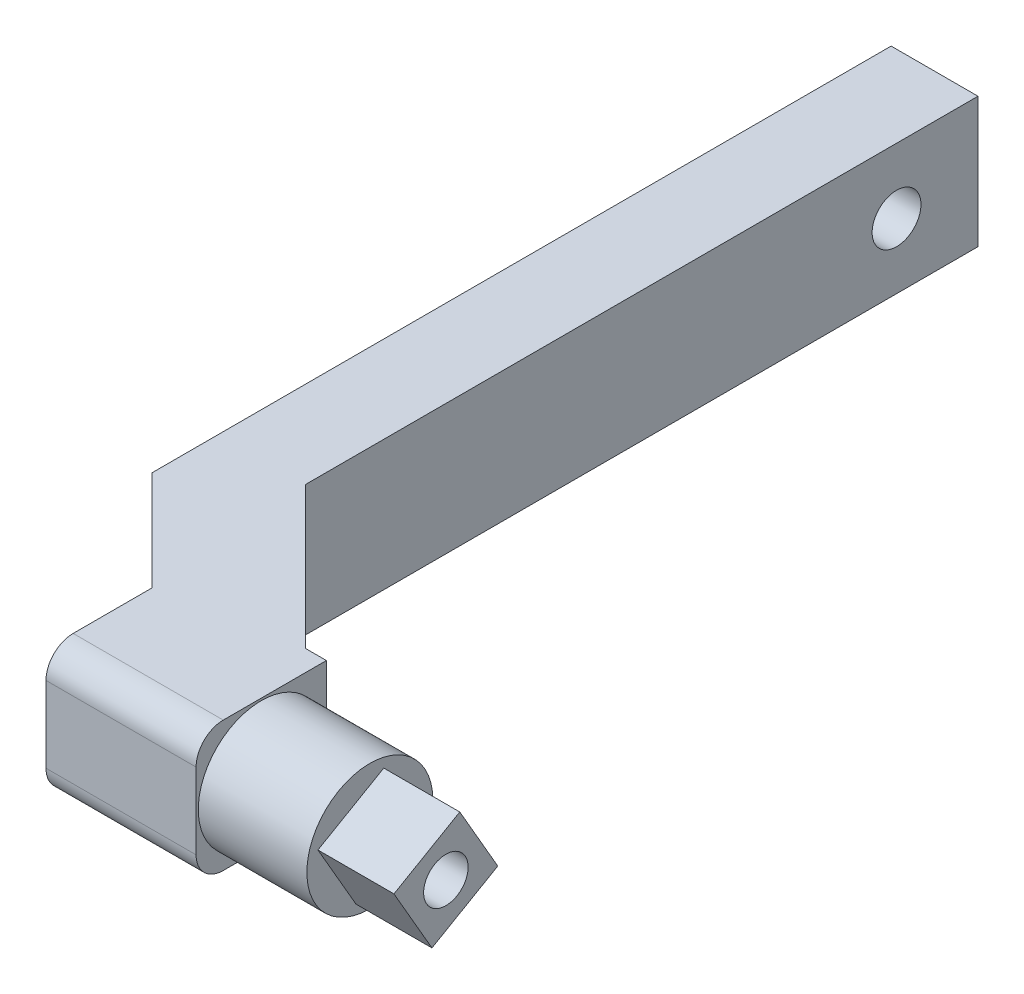
ISO-10303-21;
HEADER;
FILE_DESCRIPTION(('STEP AP214'),'2;1');
FILE_NAME('part.step','',(''),(''),'','','');
FILE_SCHEMA(('AUTOMOTIVE_DESIGN { 1 0 10303 214 1 1 1 1 }'));
ENDSEC;
DATA;
#1=APPLICATION_CONTEXT('core data for automotive mechanical design processes');
#2=APPLICATION_PROTOCOL_DEFINITION('international standard','automotive_design',2000,#1);
#3=PRODUCT_CONTEXT('',#1,'mechanical');
#4=PRODUCT('Part','Part','',(#3));
#5=PRODUCT_RELATED_PRODUCT_CATEGORY('part','',(#4));
#6=PRODUCT_DEFINITION_FORMATION('','',#4);
#7=PRODUCT_DEFINITION_CONTEXT('part definition',#1,'design');
#8=PRODUCT_DEFINITION('design','',#6,#7);
#9=PRODUCT_DEFINITION_SHAPE('','',#8);
#10=(LENGTH_UNIT() NAMED_UNIT(*) SI_UNIT(.MILLI.,.METRE.));
#11=(NAMED_UNIT(*) PLANE_ANGLE_UNIT() SI_UNIT($,.RADIAN.));
#12=(NAMED_UNIT(*) SI_UNIT($,.STERADIAN.) SOLID_ANGLE_UNIT());
#13=UNCERTAINTY_MEASURE_WITH_UNIT(LENGTH_MEASURE(1.E-05),#10,'distance_accuracy_value','');
#14=(GEOMETRIC_REPRESENTATION_CONTEXT(3) GLOBAL_UNCERTAINTY_ASSIGNED_CONTEXT((#13)) GLOBAL_UNIT_ASSIGNED_CONTEXT((#10,
#11,#12)) REPRESENTATION_CONTEXT('',''));
#15=CARTESIAN_POINT('',(0.,0.,0.));
#16=DIRECTION('',(0.,0.,1.));
#17=DIRECTION('',(1.,0.,0.));
#18=AXIS2_PLACEMENT_3D('',#15,#16,#17);
#19=CARTESIAN_POINT('',(14.,24.,0.));
#20=DIRECTION('',(-1.,0.,0.));
#21=DIRECTION('',(0.,0.,1.));
#22=AXIS2_PLACEMENT_3D('',#19,#20,#21);
#23=PLANE('',#22);
#24=CARTESIAN_POINT('',(14.,12.,2.14213562373101));
#25=DIRECTION('',(1.,0.,0.));
#26=DIRECTION('',(0.,0.,-1.));
#27=AXIS2_PLACEMENT_3D('',#24,#25,#26);
#28=CIRCLE('',#27,11.6);
#29=CARTESIAN_POINT('',(14.,12.,-9.45786437626898));
#30=VERTEX_POINT('',#29);
#31=EDGE_CURVE('E167',#30,#30,#28,.T.);
#32=ORIENTED_EDGE('',*,*,#31,.T.);
#33=EDGE_LOOP('',(#32));
#34=FACE_BOUND('',#33,.T.);
#35=DIRECTION('',(0.,0.866025403784441,0.499999999999995));
#36=VECTOR('',#35,1.);
#37=CARTESIAN_POINT('',(14.,21.5621778264911,-0.42004220276011));
#38=LINE('',#37,#36);
#39=CARTESIAN_POINT('',(14.,9.43782217350888,-7.42004220276004));
#40=VERTEX_POINT('',#39);
#41=CARTESIAN_POINT('',(14.,21.5621778264911,-0.42004220276011));
#42=VERTEX_POINT('',#41);
#43=EDGE_CURVE('E163',#40,#42,#38,.T.);
#44=ORIENTED_EDGE('',*,*,#43,.F.);
#45=DIRECTION('',(0.,0.499999999999995,-0.866025403784442));
#46=VECTOR('',#45,1.);
#47=CARTESIAN_POINT('',(14.,9.43782217350888,-7.42004220276004));
#48=LINE('',#47,#46);
#49=CARTESIAN_POINT('',(14.,2.43782217350895,4.70431345022215));
#50=VERTEX_POINT('',#49);
#51=EDGE_CURVE('E160',#50,#40,#48,.T.);
#52=ORIENTED_EDGE('',*,*,#51,.F.);
#53=DIRECTION('',(0.,-0.866025403784442,-0.499999999999995));
#54=VECTOR('',#53,1.);
#55=CARTESIAN_POINT('',(14.,14.5621778264911,11.7043134502221));
#56=LINE('',#55,#54);
#57=CARTESIAN_POINT('',(14.,14.5621778264911,11.7043134502221));
#58=VERTEX_POINT('',#57);
#59=EDGE_CURVE('E56',#58,#50,#56,.T.);
#60=ORIENTED_EDGE('',*,*,#59,.F.);
#61=DIRECTION('',(0.,-0.499999999999995,0.866025403784441));
#62=VECTOR('',#61,1.);
#63=CARTESIAN_POINT('',(14.,21.5621778264911,-0.42004220276011));
#64=LINE('',#63,#62);
#65=EDGE_CURVE('E51',#42,#58,#64,.T.);
#66=ORIENTED_EDGE('',*,*,#65,.F.);
#67=EDGE_LOOP('',(#44,#52,#60,#66));
#68=FACE_BOUND('',#67,.T.);
#69=ADVANCED_FACE('F35',(#34,#68),#23,.F.);
#70=CARTESIAN_POINT('',(-5.98849367254463E-13,24.,14.1421356237333));
#71=DIRECTION('',(0.,0.,-1.));
#72=DIRECTION('',(-1.,0.,0.));
#73=AXIS2_PLACEMENT_3D('',#70,#71,#72);
#74=PLANE('',#73);
#75=DIRECTION('',(0.,-1.,0.));
#76=VECTOR('',#75,1.);
#77=CARTESIAN_POINT('',(-33.6421356237309,24.,14.1421356237318));
#78=LINE('',#77,#76);
#79=CARTESIAN_POINT('',(-33.6421356237309,19.,14.1421356237318));
#80=VERTEX_POINT('',#79);
#81=CARTESIAN_POINT('',(-33.6421356237309,5.,14.1421356237318));
#82=VERTEX_POINT('',#81);
#83=EDGE_CURVE('E209',#80,#82,#78,.T.);
#84=ORIENTED_EDGE('',*,*,#83,.T.);
#85=DIRECTION('',(1.,0.,0.));
#86=VECTOR('',#85,1.);
#87=CARTESIAN_POINT('',(-5.98849367254463E-13,5.,14.1421356237333));
#88=LINE('',#87,#86);
#89=CARTESIAN_POINT('',(-6.,5.,14.142135623731));
#90=VERTEX_POINT('',#89);
#91=EDGE_CURVE('E245',#82,#90,#88,.T.);
#92=ORIENTED_EDGE('',*,*,#91,.T.);
#93=DIRECTION('',(0.,-1.,0.));
#94=VECTOR('',#93,1.);
#95=CARTESIAN_POINT('',(-6.,0.,14.142135623731));
#96=LINE('',#95,#94);
#97=CARTESIAN_POINT('',(-6.,19.,14.142135623731));
#98=VERTEX_POINT('',#97);
#99=EDGE_CURVE('E176',#98,#90,#96,.T.);
#100=ORIENTED_EDGE('',*,*,#99,.F.);
#101=DIRECTION('',(1.,0.,0.));
#102=VECTOR('',#101,1.);
#103=CARTESIAN_POINT('',(-33.6421356237309,19.,14.1421356237318));
#104=LINE('',#103,#102);
#105=EDGE_CURVE('E243',#98,#80,#104,.F.);
#106=ORIENTED_EDGE('',*,*,#105,.T.);
#107=EDGE_LOOP('',(#84,#92,#100,#106));
#108=FACE_BOUND('',#107,.T.);
#109=ADVANCED_FACE('F266',(#108),#74,.F.);
#110=CARTESIAN_POINT('',(0.,24.,-9.857864376269));
#111=DIRECTION('',(0.,0.,-1.));
#112=DIRECTION('',(-1.,0.,0.));
#113=AXIS2_PLACEMENT_3D('',#110,#111,#112);
#114=PLANE('',#113);
#115=DIRECTION('',(1.,0.,0.));
#116=VECTOR('',#115,1.);
#117=CARTESIAN_POINT('',(0.,24.,-9.857864376269));
#118=LINE('',#117,#116);
#119=CARTESIAN_POINT('',(-9.85786437626935,24.,-9.857864376269));
#120=VERTEX_POINT('',#119);
#121=CARTESIAN_POINT('',(-5.99999999999997,24.,-9.85786437626902));
#122=VERTEX_POINT('',#121);
#123=EDGE_CURVE('E189',#120,#122,#118,.T.);
#124=ORIENTED_EDGE('',*,*,#123,.T.);
#125=DIRECTION('',(0.,1.,0.));
#126=VECTOR('',#125,1.);
#127=CARTESIAN_POINT('',(-5.99999999999997,0.,-9.85786437626902));
#128=LINE('',#127,#126);
#129=CARTESIAN_POINT('',(-5.99999999999997,0.,-9.85786437626902));
#130=VERTEX_POINT('',#129);
#131=EDGE_CURVE('E181',#130,#122,#128,.T.);
#132=ORIENTED_EDGE('',*,*,#131,.F.);
#133=DIRECTION('',(1.,0.,0.));
#134=VECTOR('',#133,1.);
#135=CARTESIAN_POINT('',(0.,0.,-9.857864376269));
#136=LINE('',#135,#134);
#137=CARTESIAN_POINT('',(-9.85786437626935,0.,-9.857864376269));
#138=VERTEX_POINT('',#137);
#139=EDGE_CURVE('E186',#138,#130,#136,.T.);
#140=ORIENTED_EDGE('',*,*,#139,.F.);
#141=DIRECTION('',(0.,-1.,0.));
#142=VECTOR('',#141,1.);
#143=CARTESIAN_POINT('',(-9.85786437626935,24.,-9.857864376269));
#144=LINE('',#143,#142);
#145=EDGE_CURVE('E241',#120,#138,#144,.T.);
#146=ORIENTED_EDGE('',*,*,#145,.F.);
#147=EDGE_LOOP('',(#124,#132,#140,#146));
#148=FACE_BOUND('',#147,.T.);
#149=ADVANCED_FACE('F280',(#148),#114,.T.);
#150=CARTESIAN_POINT('',(0.,24.,0.));
#151=DIRECTION('',(0.,1.,0.));
#152=DIRECTION('',(0.,0.,1.));
#153=AXIS2_PLACEMENT_3D('',#150,#151,#152);
#154=PLANE('',#153);
#155=DIRECTION('',(0.,0.,1.));
#156=VECTOR('',#155,1.);
#157=CARTESIAN_POINT('',(-33.6421356237305,24.,-8.97843114592054E-13));
#158=LINE('',#157,#156);
#159=CARTESIAN_POINT('',(-33.6421356237304,24.,-5.35786437626736));
#160=VERTEX_POINT('',#159);
#161=CARTESIAN_POINT('',(-33.6421356237308,24.,9.14213562373183));
#162=VERTEX_POINT('',#161);
#163=EDGE_CURVE('E206',#160,#162,#158,.T.);
#164=ORIENTED_EDGE('',*,*,#163,.T.);
#165=DIRECTION('',(1.,0.,0.));
#166=VECTOR('',#165,1.);
#167=CARTESIAN_POINT('',(-5.99999999999979,24.,9.142135623733));
#168=LINE('',#167,#166);
#169=CARTESIAN_POINT('',(-5.99999999999999,24.,9.142135623733));
#170=VERTEX_POINT('',#169);
#171=EDGE_CURVE('E11',#162,#170,#168,.T.);
#172=ORIENTED_EDGE('',*,*,#171,.T.);
#173=DIRECTION('',(0.,0.,1.));
#174=VECTOR('',#173,1.);
#175=CARTESIAN_POINT('',(-5.99999999999998,24.,0.));
#176=LINE('',#175,#174);
#177=EDGE_CURVE('E183',#122,#170,#176,.T.);
#178=ORIENTED_EDGE('',*,*,#177,.F.);
#179=ORIENTED_EDGE('',*,*,#123,.F.);
#180=DIRECTION('',(-0.70710678118656,0.,-0.707106781186535));
#181=VECTOR('',#180,1.);
#182=CARTESIAN_POINT('',(0.,24.,0.));
#183=LINE('',#182,#181);
#184=CARTESIAN_POINT('',(-35.9999999999993,24.,-35.999999999998));
#185=VERTEX_POINT('',#184);
#186=EDGE_CURVE('E192',#120,#185,#183,.T.);
#187=ORIENTED_EDGE('',*,*,#186,.T.);
#188=DIRECTION('',(0.,0.,-1.));
#189=VECTOR('',#188,1.);
#190=CARTESIAN_POINT('',(-35.9999999999993,24.,0.));
#191=LINE('',#190,#189);
#192=CARTESIAN_POINT('',(-35.9999999999993,24.,-159.857864376267));
#193=VERTEX_POINT('',#192);
#194=EDGE_CURVE('E195',#185,#193,#191,.T.);
#195=ORIENTED_EDGE('',*,*,#194,.T.);
#196=DIRECTION('',(1.,0.,0.));
#197=VECTOR('',#196,1.);
#198=CARTESIAN_POINT('',(-2.77309190153028E-13,24.,-159.857864376267));
#199=LINE('',#198,#197);
#200=CARTESIAN_POINT('',(-51.9999999999993,24.,-159.857864376267));
#201=VERTEX_POINT('',#200);
#202=EDGE_CURVE('E197',#201,#193,#199,.T.);
#203=ORIENTED_EDGE('',*,*,#202,.F.);
#204=DIRECTION('',(0.,0.,-1.));
#205=VECTOR('',#204,1.);
#206=CARTESIAN_POINT('',(-51.9999999999992,24.,0.));
#207=LINE('',#206,#205);
#208=CARTESIAN_POINT('',(-51.9999999999992,24.,-23.715728752536));
#209=VERTEX_POINT('',#208);
#210=EDGE_CURVE('E200',#209,#201,#207,.T.);
#211=ORIENTED_EDGE('',*,*,#210,.F.);
#212=DIRECTION('',(-0.707106781186552,0.,-0.707106781186544));
#213=VECTOR('',#212,1.);
#214=CARTESIAN_POINT('',(-14.1421356237313,24.,14.1421356237315));
#215=LINE('',#214,#213);
#216=EDGE_CURVE('E203',#160,#209,#215,.T.);
#217=ORIENTED_EDGE('',*,*,#216,.F.);
#218=EDGE_LOOP('',(#164,#172,#178,#179,#187,#195,#203,#211,#217));
#219=FACE_BOUND('',#218,.T.);
#220=ADVANCED_FACE('F285',(#219),#154,.T.);
#221=CARTESIAN_POINT('',(0.,0.,0.));
#222=DIRECTION('',(0.,1.,0.));
#223=DIRECTION('',(0.,0.,1.));
#224=AXIS2_PLACEMENT_3D('',#221,#222,#223);
#225=PLANE('',#224);
#226=DIRECTION('',(0.,0.,-1.));
#227=VECTOR('',#226,1.);
#228=CARTESIAN_POINT('',(-5.99999999999998,0.,0.));
#229=LINE('',#228,#227);
#230=CARTESIAN_POINT('',(-5.99999999999999,0.,9.142135623733));
#231=VERTEX_POINT('',#230);
#232=EDGE_CURVE('E179',#231,#130,#229,.T.);
#233=ORIENTED_EDGE('',*,*,#232,.F.);
#234=DIRECTION('',(1.,0.,0.));
#235=VECTOR('',#234,1.);
#236=CARTESIAN_POINT('',(-3.87124143007046E-13,0.,9.14213562373326));
#237=LINE('',#236,#235);
#238=CARTESIAN_POINT('',(-33.6421356237308,0.,9.14213562373183));
#239=VERTEX_POINT('',#238);
#240=EDGE_CURVE('E252',#231,#239,#237,.F.);
#241=ORIENTED_EDGE('',*,*,#240,.T.);
#242=DIRECTION('',(0.,0.,1.));
#243=VECTOR('',#242,1.);
#244=CARTESIAN_POINT('',(-33.6421356237305,0.,-8.97843114592054E-13));
#245=LINE('',#244,#243);
#246=CARTESIAN_POINT('',(-33.6421356237304,0.,-5.35786437626736));
#247=VERTEX_POINT('',#246);
#248=EDGE_CURVE('E193',#247,#239,#245,.T.);
#249=ORIENTED_EDGE('',*,*,#248,.F.);
#250=DIRECTION('',(-0.707106781186552,0.,-0.707106781186544));
#251=VECTOR('',#250,1.);
#252=CARTESIAN_POINT('',(-14.1421356237313,0.,14.1421356237315));
#253=LINE('',#252,#251);
#254=CARTESIAN_POINT('',(-51.9999999999992,0.,-23.715728752536));
#255=VERTEX_POINT('',#254);
#256=EDGE_CURVE('E223',#247,#255,#253,.T.);
#257=ORIENTED_EDGE('',*,*,#256,.T.);
#258=DIRECTION('',(0.,0.,-1.));
#259=VECTOR('',#258,1.);
#260=CARTESIAN_POINT('',(-51.9999999999992,0.,0.));
#261=LINE('',#260,#259);
#262=CARTESIAN_POINT('',(-51.9999999999993,0.,-159.857864376267));
#263=VERTEX_POINT('',#262);
#264=EDGE_CURVE('E220',#255,#263,#261,.T.);
#265=ORIENTED_EDGE('',*,*,#264,.T.);
#266=DIRECTION('',(1.,0.,0.));
#267=VECTOR('',#266,1.);
#268=CARTESIAN_POINT('',(-2.77309190153028E-13,0.,-159.857864376267));
#269=LINE('',#268,#267);
#270=CARTESIAN_POINT('',(-35.9999999999993,0.,-159.857864376267));
#271=VERTEX_POINT('',#270);
#272=EDGE_CURVE('E217',#263,#271,#269,.T.);
#273=ORIENTED_EDGE('',*,*,#272,.T.);
#274=DIRECTION('',(0.,0.,-1.));
#275=VECTOR('',#274,1.);
#276=CARTESIAN_POINT('',(-35.9999999999993,0.,0.));
#277=LINE('',#276,#275);
#278=CARTESIAN_POINT('',(-35.9999999999993,0.,-35.999999999998));
#279=VERTEX_POINT('',#278);
#280=EDGE_CURVE('E214',#279,#271,#277,.T.);
#281=ORIENTED_EDGE('',*,*,#280,.F.);
#282=DIRECTION('',(-0.70710678118656,0.,-0.707106781186535));
#283=VECTOR('',#282,1.);
#284=CARTESIAN_POINT('',(0.,0.,0.));
#285=LINE('',#284,#283);
#286=EDGE_CURVE('E212',#138,#279,#285,.T.);
#287=ORIENTED_EDGE('',*,*,#286,.F.);
#288=ORIENTED_EDGE('',*,*,#139,.T.);
#289=EDGE_LOOP('',(#233,#241,#249,#257,#265,#273,#281,#287,#288));
#290=FACE_BOUND('',#289,.T.);
#291=ADVANCED_FACE('F275',(#290),#225,.F.);
#292=CARTESIAN_POINT('',(0.,24.,0.));
#293=DIRECTION('',(-0.707106781186535,0.,0.70710678118656));
#294=DIRECTION('',(0.70710678118656,0.,0.707106781186535));
#295=AXIS2_PLACEMENT_3D('',#292,#293,#294);
#296=PLANE('',#295);
#297=ORIENTED_EDGE('',*,*,#286,.T.);
#298=DIRECTION('',(0.,-1.,0.));
#299=VECTOR('',#298,1.);
#300=CARTESIAN_POINT('',(-35.9999999999993,24.,-35.999999999998));
#301=LINE('',#300,#299);
#302=EDGE_CURVE('E238',#185,#279,#301,.T.);
#303=ORIENTED_EDGE('',*,*,#302,.F.);
#304=ORIENTED_EDGE('',*,*,#186,.F.);
#305=ORIENTED_EDGE('',*,*,#145,.T.);
#306=EDGE_LOOP('',(#297,#303,#304,#305));
#307=FACE_BOUND('',#306,.T.);
#308=ADVANCED_FACE('F307',(#307),#296,.F.);
#309=CARTESIAN_POINT('',(-35.9999999999993,24.,0.));
#310=DIRECTION('',(-1.,0.,0.));
#311=DIRECTION('',(0.,0.,1.));
#312=AXIS2_PLACEMENT_3D('',#309,#310,#311);
#313=PLANE('',#312);
#314=CARTESIAN_POINT('',(-35.9999999999993,12.,-144.857864376268));
#315=DIRECTION('',(-1.,0.,0.));
#316=DIRECTION('',(0.,0.,1.));
#317=AXIS2_PLACEMENT_3D('',#314,#315,#316);
#318=CIRCLE('',#317,4.49999999999999);
#319=CARTESIAN_POINT('',(-35.9999999999993,12.,-140.357864376268));
#320=VERTEX_POINT('',#319);
#321=EDGE_CURVE('E39',#320,#320,#318,.T.);
#322=ORIENTED_EDGE('',*,*,#321,.T.);
#323=EDGE_LOOP('',(#322));
#324=FACE_BOUND('',#323,.T.);
#325=ORIENTED_EDGE('',*,*,#280,.T.);
#326=DIRECTION('',(0.,-1.,0.));
#327=VECTOR('',#326,1.);
#328=CARTESIAN_POINT('',(-35.9999999999993,24.,-159.857864376267));
#329=LINE('',#328,#327);
#330=EDGE_CURVE('E236',#193,#271,#329,.T.);
#331=ORIENTED_EDGE('',*,*,#330,.F.);
#332=ORIENTED_EDGE('',*,*,#194,.F.);
#333=ORIENTED_EDGE('',*,*,#302,.T.);
#334=EDGE_LOOP('',(#325,#331,#332,#333));
#335=FACE_BOUND('',#334,.T.);
#336=ADVANCED_FACE('F304',(#324,#335),#313,.F.);
#337=CARTESIAN_POINT('',(-2.77309190153028E-13,24.,-159.857864376267));
#338=DIRECTION('',(0.,0.,-1.));
#339=DIRECTION('',(-1.,0.,0.));
#340=AXIS2_PLACEMENT_3D('',#337,#338,#339);
#341=PLANE('',#340);
#342=ORIENTED_EDGE('',*,*,#272,.F.);
#343=DIRECTION('',(0.,-1.,0.));
#344=VECTOR('',#343,1.);
#345=CARTESIAN_POINT('',(-51.9999999999993,24.,-159.857864376267));
#346=LINE('',#345,#344);
#347=EDGE_CURVE('E234',#201,#263,#346,.T.);
#348=ORIENTED_EDGE('',*,*,#347,.F.);
#349=ORIENTED_EDGE('',*,*,#202,.T.);
#350=ORIENTED_EDGE('',*,*,#330,.T.);
#351=EDGE_LOOP('',(#342,#348,#349,#350));
#352=FACE_BOUND('',#351,.T.);
#353=ADVANCED_FACE('F300',(#352),#341,.T.);
#354=CARTESIAN_POINT('',(-51.9999999999992,24.,0.));
#355=DIRECTION('',(-1.,0.,0.));
#356=DIRECTION('',(0.,0.,1.));
#357=AXIS2_PLACEMENT_3D('',#354,#355,#356);
#358=PLANE('',#357);
#359=CARTESIAN_POINT('',(-51.9999999999981,12.,-144.857864376268));
#360=DIRECTION('',(-1.,0.,0.));
#361=DIRECTION('',(0.,0.,1.));
#362=AXIS2_PLACEMENT_3D('',#359,#360,#361);
#363=CIRCLE('',#362,11.1);
#364=CARTESIAN_POINT('',(-51.9999999999982,12.,-133.757864376268));
#365=VERTEX_POINT('',#364);
#366=EDGE_CURVE('E488',#365,#365,#363,.T.);
#367=ORIENTED_EDGE('',*,*,#366,.F.);
#368=EDGE_LOOP('',(#367));
#369=FACE_BOUND('',#368,.T.);
#370=ORIENTED_EDGE('',*,*,#264,.F.);
#371=DIRECTION('',(0.,-1.,0.));
#372=VECTOR('',#371,1.);
#373=CARTESIAN_POINT('',(-51.9999999999992,24.,-23.715728752536));
#374=LINE('',#373,#372);
#375=EDGE_CURVE('E232',#209,#255,#374,.T.);
#376=ORIENTED_EDGE('',*,*,#375,.F.);
#377=ORIENTED_EDGE('',*,*,#210,.T.);
#378=ORIENTED_EDGE('',*,*,#347,.T.);
#379=EDGE_LOOP('',(#370,#376,#377,#378));
#380=FACE_BOUND('',#379,.T.);
#381=ADVANCED_FACE('F298',(#369,#380),#358,.T.);
#382=CARTESIAN_POINT('',(-14.1421356237313,24.,14.1421356237315));
#383=DIRECTION('',(-0.707106781186544,0.,0.707106781186551));
#384=DIRECTION('',(0.707106781186551,0.,0.707106781186544));
#385=AXIS2_PLACEMENT_3D('',#382,#383,#384);
#386=PLANE('',#385);
#387=ORIENTED_EDGE('',*,*,#256,.F.);
#388=DIRECTION('',(0.,-1.,0.));
#389=VECTOR('',#388,1.);
#390=CARTESIAN_POINT('',(-33.6421356237304,24.,-5.35786437626736));
#391=LINE('',#390,#389);
#392=EDGE_CURVE('E230',#160,#247,#391,.T.);
#393=ORIENTED_EDGE('',*,*,#392,.F.);
#394=ORIENTED_EDGE('',*,*,#216,.T.);
#395=ORIENTED_EDGE('',*,*,#375,.T.);
#396=EDGE_LOOP('',(#387,#393,#394,#395));
#397=FACE_BOUND('',#396,.T.);
#398=ADVANCED_FACE('F294',(#397),#386,.T.);
#399=CARTESIAN_POINT('',(-33.6421356237305,24.,-8.97843114592054E-13));
#400=DIRECTION('',(1.,0.,0.));
#401=DIRECTION('',(0.,0.,-1.));
#402=AXIS2_PLACEMENT_3D('',#399,#400,#401);
#403=PLANE('',#402);
#404=CARTESIAN_POINT('',(-33.6421356237306,12.,2.14213562373096));
#405=DIRECTION('',(1.,0.,0.));
#406=DIRECTION('',(0.,0.,-1.));
#407=AXIS2_PLACEMENT_3D('',#404,#405,#406);
#408=CIRCLE('',#407,4.1);
#409=CARTESIAN_POINT('',(-33.6421356237305,12.,-1.95786437626904));
#410=VERTEX_POINT('',#409);
#411=EDGE_CURVE('E164',#410,#410,#408,.T.);
#412=ORIENTED_EDGE('',*,*,#411,.T.);
#413=EDGE_LOOP('',(#412));
#414=FACE_BOUND('',#413,.T.);
#415=ORIENTED_EDGE('',*,*,#248,.T.);
#416=CARTESIAN_POINT('',(-33.6421356237308,5.,9.14213562373183));
#417=DIRECTION('',(1.,0.,0.));
#418=DIRECTION('',(0.,0.,-1.));
#419=AXIS2_PLACEMENT_3D('',#416,#417,#418);
#420=CIRCLE('',#419,5.);
#421=EDGE_CURVE('E44',#239,#82,#420,.F.);
#422=ORIENTED_EDGE('',*,*,#421,.T.);
#423=ORIENTED_EDGE('',*,*,#83,.F.);
#424=CARTESIAN_POINT('',(-33.6421356237308,19.,9.14213562373183));
#425=DIRECTION('',(1.,0.,0.));
#426=DIRECTION('',(0.,0.,-1.));
#427=AXIS2_PLACEMENT_3D('',#424,#425,#426);
#428=CIRCLE('',#427,5.);
#429=EDGE_CURVE('E254',#80,#162,#428,.F.);
#430=ORIENTED_EDGE('',*,*,#429,.T.);
#431=ORIENTED_EDGE('',*,*,#163,.F.);
#432=ORIENTED_EDGE('',*,*,#392,.T.);
#433=EDGE_LOOP('',(#415,#422,#423,#430,#431,#432));
#434=FACE_BOUND('',#433,.T.);
#435=ADVANCED_FACE('F259',(#414,#434),#403,.F.);
#436=CARTESIAN_POINT('',(-5.99999999999998,12.,2.14213562373099));
#437=DIRECTION('',(1.,0.,0.));
#438=DIRECTION('',(0.,0.,-1.));
#439=AXIS2_PLACEMENT_3D('',#436,#437,#438);
#440=CYLINDRICAL_SURFACE('',#439,11.6);
#441=CARTESIAN_POINT('',(-5.99999999999998,12.,2.14213562373099));
#442=DIRECTION('',(1.,0.,0.));
#443=DIRECTION('',(0.,0.,-1.));
#444=AXIS2_PLACEMENT_3D('',#441,#442,#443);
#445=CIRCLE('',#444,11.6);
#446=CARTESIAN_POINT('',(-5.99999999999997,12.,-9.45786437626901));
#447=VERTEX_POINT('',#446);
#448=EDGE_CURVE('E173',#447,#447,#445,.T.);
#449=ORIENTED_EDGE('',*,*,#448,.T.);
#450=EDGE_LOOP('',(#449));
#451=FACE_BOUND('',#450,.T.);
#452=ORIENTED_EDGE('',*,*,#31,.F.);
#453=EDGE_LOOP('',(#452));
#454=FACE_BOUND('',#453,.T.);
#455=ADVANCED_FACE('F336',(#451,#454),#440,.T.);
#456=CARTESIAN_POINT('',(-5.99999999999998,0.,0.));
#457=DIRECTION('',(1.,0.,0.));
#458=DIRECTION('',(0.,0.,-1.));
#459=AXIS2_PLACEMENT_3D('',#456,#457,#458);
#460=PLANE('',#459);
#461=ORIENTED_EDGE('',*,*,#448,.F.);
#462=EDGE_LOOP('',(#461));
#463=FACE_BOUND('',#462,.T.);
#464=ORIENTED_EDGE('',*,*,#99,.T.);
#465=CARTESIAN_POINT('',(-5.99999999999999,5.,9.142135623733));
#466=DIRECTION('',(1.,0.,0.));
#467=DIRECTION('',(0.,0.,-1.));
#468=AXIS2_PLACEMENT_3D('',#465,#466,#467);
#469=CIRCLE('',#468,5.);
#470=EDGE_CURVE('E250',#90,#231,#469,.T.);
#471=ORIENTED_EDGE('',*,*,#470,.T.);
#472=ORIENTED_EDGE('',*,*,#232,.T.);
#473=ORIENTED_EDGE('',*,*,#131,.T.);
#474=ORIENTED_EDGE('',*,*,#177,.T.);
#475=CARTESIAN_POINT('',(-5.99999999999999,19.,9.142135623733));
#476=DIRECTION('',(1.,0.,0.));
#477=DIRECTION('',(0.,0.,-1.));
#478=AXIS2_PLACEMENT_3D('',#475,#476,#477);
#479=CIRCLE('',#478,5.);
#480=EDGE_CURVE('E248',#170,#98,#479,.T.);
#481=ORIENTED_EDGE('',*,*,#480,.T.);
#482=EDGE_LOOP('',(#464,#471,#472,#473,#474,#481));
#483=FACE_BOUND('',#482,.T.);
#484=ADVANCED_FACE('F272',(#463,#483),#460,.T.);
#485=CARTESIAN_POINT('',(-51.9999999999995,12.,2.14213562373094));
#486=DIRECTION('',(1.,0.,0.));
#487=DIRECTION('',(0.,0.,-1.));
#488=AXIS2_PLACEMENT_3D('',#485,#486,#487);
#489=CYLINDRICAL_SURFACE('',#488,4.1);
#490=ORIENTED_EDGE('',*,*,#411,.F.);
#491=EDGE_LOOP('',(#490));
#492=FACE_BOUND('',#491,.T.);
#493=CARTESIAN_POINT('',(28.,12.,2.14213562373101));
#494=DIRECTION('',(1.,0.,0.));
#495=DIRECTION('',(0.,0.,-1.));
#496=AXIS2_PLACEMENT_3D('',#493,#494,#495);
#497=CIRCLE('',#496,4.1);
#498=CARTESIAN_POINT('',(28.,12.,-1.95786437626899));
#499=VERTEX_POINT('',#498);
#500=EDGE_CURVE('E495',#499,#499,#497,.T.);
#501=ORIENTED_EDGE('',*,*,#500,.T.);
#502=EDGE_LOOP('',(#501));
#503=FACE_BOUND('',#502,.T.);
#504=ADVANCED_FACE('F326',(#492,#503),#489,.F.);
#505=CARTESIAN_POINT('',(-3.87124143007046E-13,5.,9.14213562373326));
#506=DIRECTION('',(1.,0.,0.));
#507=DIRECTION('',(0.,0.,-1.));
#508=AXIS2_PLACEMENT_3D('',#505,#506,#507);
#509=CYLINDRICAL_SURFACE('',#508,5.);
#510=ORIENTED_EDGE('',*,*,#421,.F.);
#511=ORIENTED_EDGE('',*,*,#240,.F.);
#512=ORIENTED_EDGE('',*,*,#470,.F.);
#513=ORIENTED_EDGE('',*,*,#91,.F.);
#514=EDGE_LOOP('',(#510,#511,#512,#513));
#515=FACE_BOUND('',#514,.T.);
#516=ADVANCED_FACE('F269',(#515),#509,.T.);
#517=CARTESIAN_POINT('',(-3.87124143007046E-13,19.,9.14213562373326));
#518=DIRECTION('',(-1.,0.,0.));
#519=DIRECTION('',(0.,0.,1.));
#520=AXIS2_PLACEMENT_3D('',#517,#518,#519);
#521=CYLINDRICAL_SURFACE('',#520,5.);
#522=ORIENTED_EDGE('',*,*,#429,.F.);
#523=ORIENTED_EDGE('',*,*,#105,.F.);
#524=ORIENTED_EDGE('',*,*,#480,.F.);
#525=ORIENTED_EDGE('',*,*,#171,.F.);
#526=EDGE_LOOP('',(#522,#523,#524,#525));
#527=FACE_BOUND('',#526,.T.);
#528=ADVANCED_FACE('F37',(#527),#521,.T.);
#529=CARTESIAN_POINT('',(28.,21.5621778264911,-0.420042202760102));
#530=DIRECTION('',(0.,-0.499999999999995,0.866025403784441));
#531=DIRECTION('',(0.,-0.866025403784441,-0.499999999999995));
#532=AXIS2_PLACEMENT_3D('',#529,#530,#531);
#533=PLANE('',#532);
#534=ORIENTED_EDGE('',*,*,#43,.T.);
#535=DIRECTION('',(-1.,0.,0.));
#536=VECTOR('',#535,1.);
#537=CARTESIAN_POINT('',(28.,21.5621778264911,-0.420042202760102));
#538=LINE('',#537,#536);
#539=CARTESIAN_POINT('',(28.,21.5621778264911,-0.420042202760102));
#540=VERTEX_POINT('',#539);
#541=EDGE_CURVE('E144',#540,#42,#538,.T.);
#542=ORIENTED_EDGE('',*,*,#541,.F.);
#543=DIRECTION('',(0.,0.866025403784441,0.499999999999995));
#544=VECTOR('',#543,1.);
#545=CARTESIAN_POINT('',(28.,21.5621778264911,-0.420042202760102));
#546=LINE('',#545,#544);
#547=CARTESIAN_POINT('',(28.,9.43782217350888,-7.42004220276003));
#548=VERTEX_POINT('',#547);
#549=EDGE_CURVE('E151',#548,#540,#546,.T.);
#550=ORIENTED_EDGE('',*,*,#549,.F.);
#551=DIRECTION('',(-1.,0.,0.));
#552=VECTOR('',#551,1.);
#553=CARTESIAN_POINT('',(28.,9.43782217350888,-7.42004220276003));
#554=LINE('',#553,#552);
#555=EDGE_CURVE('E501',#548,#40,#554,.T.);
#556=ORIENTED_EDGE('',*,*,#555,.T.);
#557=EDGE_LOOP('',(#534,#542,#550,#556));
#558=FACE_BOUND('',#557,.T.);
#559=ADVANCED_FACE('F162',(#558),#533,.F.);
#560=CARTESIAN_POINT('',(28.,21.5621778264911,-0.420042202760102));
#561=DIRECTION('',(0.,-0.866025403784441,-0.499999999999995));
#562=DIRECTION('',(0.,0.499999999999995,-0.866025403784442));
#563=AXIS2_PLACEMENT_3D('',#560,#561,#562);
#564=PLANE('',#563);
#565=ORIENTED_EDGE('',*,*,#65,.T.);
#566=DIRECTION('',(-1.,0.,0.));
#567=VECTOR('',#566,1.);
#568=CARTESIAN_POINT('',(28.,14.5621778264911,11.7043134502221));
#569=LINE('',#568,#567);
#570=CARTESIAN_POINT('',(28.,14.5621778264911,11.7043134502221));
#571=VERTEX_POINT('',#570);
#572=EDGE_CURVE('E147',#571,#58,#569,.T.);
#573=ORIENTED_EDGE('',*,*,#572,.F.);
#574=DIRECTION('',(0.,-0.499999999999995,0.866025403784441));
#575=VECTOR('',#574,1.);
#576=CARTESIAN_POINT('',(28.,21.5621778264911,-0.420042202760102));
#577=LINE('',#576,#575);
#578=EDGE_CURVE('E140',#540,#571,#577,.T.);
#579=ORIENTED_EDGE('',*,*,#578,.F.);
#580=ORIENTED_EDGE('',*,*,#541,.T.);
#581=EDGE_LOOP('',(#565,#573,#579,#580));
#582=FACE_BOUND('',#581,.T.);
#583=ADVANCED_FACE('F142',(#582),#564,.F.);
#584=CARTESIAN_POINT('',(28.,14.5621778264911,11.7043134502221));
#585=DIRECTION('',(0.,0.499999999999995,-0.866025403784441));
#586=DIRECTION('',(0.,0.866025403784441,0.499999999999995));
#587=AXIS2_PLACEMENT_3D('',#584,#585,#586);
#588=PLANE('',#587);
#589=ORIENTED_EDGE('',*,*,#59,.T.);
#590=DIRECTION('',(-1.,0.,0.));
#591=VECTOR('',#590,1.);
#592=CARTESIAN_POINT('',(28.,2.43782217350895,4.70431345022215));
#593=LINE('',#592,#591);
#594=CARTESIAN_POINT('',(28.,2.43782217350895,4.70431345022215));
#595=VERTEX_POINT('',#594);
#596=EDGE_CURVE('E169',#595,#50,#593,.T.);
#597=ORIENTED_EDGE('',*,*,#596,.F.);
#598=DIRECTION('',(0.,-0.866025403784442,-0.499999999999995));
#599=VECTOR('',#598,1.);
#600=CARTESIAN_POINT('',(28.,14.5621778264911,11.7043134502221));
#601=LINE('',#600,#599);
#602=EDGE_CURVE('E150',#571,#595,#601,.T.);
#603=ORIENTED_EDGE('',*,*,#602,.F.);
#604=ORIENTED_EDGE('',*,*,#572,.T.);
#605=EDGE_LOOP('',(#589,#597,#603,#604));
#606=FACE_BOUND('',#605,.T.);
#607=ADVANCED_FACE('F419',(#606),#588,.F.);
#608=CARTESIAN_POINT('',(28.,9.43782217350888,-7.42004220276003));
#609=DIRECTION('',(0.,0.866025403784442,0.499999999999995));
#610=DIRECTION('',(0.,-0.499999999999995,0.866025403784442));
#611=AXIS2_PLACEMENT_3D('',#608,#609,#610);
#612=PLANE('',#611);
#613=ORIENTED_EDGE('',*,*,#51,.T.);
#614=ORIENTED_EDGE('',*,*,#555,.F.);
#615=DIRECTION('',(0.,0.499999999999995,-0.866025403784442));
#616=VECTOR('',#615,1.);
#617=CARTESIAN_POINT('',(28.,9.43782217350888,-7.42004220276003));
#618=LINE('',#617,#616);
#619=EDGE_CURVE('E156',#595,#548,#618,.T.);
#620=ORIENTED_EDGE('',*,*,#619,.F.);
#621=ORIENTED_EDGE('',*,*,#596,.T.);
#622=EDGE_LOOP('',(#613,#614,#620,#621));
#623=FACE_BOUND('',#622,.T.);
#624=ADVANCED_FACE('F427',(#623),#612,.F.);
#625=CARTESIAN_POINT('',(28.,0.,0.));
#626=DIRECTION('',(-1.,0.,0.));
#627=DIRECTION('',(0.,0.,1.));
#628=AXIS2_PLACEMENT_3D('',#625,#626,#627);
#629=PLANE('',#628);
#630=ORIENTED_EDGE('',*,*,#500,.F.);
#631=EDGE_LOOP('',(#630));
#632=FACE_BOUND('',#631,.T.);
#633=ORIENTED_EDGE('',*,*,#549,.T.);
#634=ORIENTED_EDGE('',*,*,#578,.T.);
#635=ORIENTED_EDGE('',*,*,#602,.T.);
#636=ORIENTED_EDGE('',*,*,#619,.T.);
#637=EDGE_LOOP('',(#633,#634,#635,#636));
#638=FACE_BOUND('',#637,.T.);
#639=ADVANCED_FACE('F154',(#632,#638),#629,.F.);
#640=CARTESIAN_POINT('',(-44.8999999999981,12.,-144.857864376267));
#641=DIRECTION('',(-1.,0.,0.));
#642=DIRECTION('',(0.,0.,1.));
#643=AXIS2_PLACEMENT_3D('',#640,#641,#642);
#644=CYLINDRICAL_SURFACE('',#643,11.1);
#645=CARTESIAN_POINT('',(-44.8999999999981,12.,-144.857864376267));
#646=DIRECTION('',(-1.,0.,0.));
#647=DIRECTION('',(0.,0.,1.));
#648=AXIS2_PLACEMENT_3D('',#645,#646,#647);
#649=CIRCLE('',#648,11.1);
#650=CARTESIAN_POINT('',(-44.8999999999982,12.,-133.757864376267));
#651=VERTEX_POINT('',#650);
#652=EDGE_CURVE('E490',#651,#651,#649,.T.);
#653=ORIENTED_EDGE('',*,*,#652,.F.);
#654=EDGE_LOOP('',(#653));
#655=FACE_BOUND('',#654,.T.);
#656=ORIENTED_EDGE('',*,*,#366,.T.);
#657=EDGE_LOOP('',(#656));
#658=FACE_BOUND('',#657,.T.);
#659=ADVANCED_FACE('F449',(#655,#658),#644,.F.);
#660=CARTESIAN_POINT('',(-44.8999999999981,12.,-144.857864376267));
#661=DIRECTION('',(-1.,0.,0.));
#662=DIRECTION('',(0.,0.,1.));
#663=AXIS2_PLACEMENT_3D('',#660,#661,#662);
#664=PLANE('',#663);
#665=CARTESIAN_POINT('',(-44.8999999999981,12.,-144.857864376268));
#666=DIRECTION('',(-1.,0.,0.));
#667=DIRECTION('',(0.,0.,1.));
#668=AXIS2_PLACEMENT_3D('',#665,#666,#667);
#669=CIRCLE('',#668,4.49999999999999);
#670=CARTESIAN_POINT('',(-44.8999999999982,12.,-140.357864376268));
#671=VERTEX_POINT('',#670);
#672=EDGE_CURVE('E485',#671,#671,#669,.T.);
#673=ORIENTED_EDGE('',*,*,#672,.F.);
#674=EDGE_LOOP('',(#673));
#675=FACE_BOUND('',#674,.T.);
#676=ORIENTED_EDGE('',*,*,#652,.T.);
#677=EDGE_LOOP('',(#676));
#678=FACE_BOUND('',#677,.T.);
#679=ADVANCED_FACE('F458',(#675,#678),#664,.T.);
#680=CARTESIAN_POINT('',(28.0000000000013,12.,-144.857864376267));
#681=DIRECTION('',(-1.,0.,0.));
#682=DIRECTION('',(0.,0.,1.));
#683=AXIS2_PLACEMENT_3D('',#680,#681,#682);
#684=CYLINDRICAL_SURFACE('',#683,4.49999999999999);
#685=ORIENTED_EDGE('',*,*,#672,.T.);
#686=EDGE_LOOP('',(#685));
#687=FACE_BOUND('',#686,.T.);
#688=ORIENTED_EDGE('',*,*,#321,.F.);
#689=EDGE_LOOP('',(#688));
#690=FACE_BOUND('',#689,.T.);
#691=ADVANCED_FACE('F465',(#687,#690),#684,.F.);
#692=CLOSED_SHELL('',(#69,#109,#149,#220,#291,#308,#336,#353,#381,#398,#435,#455,#484,#504,#516,
#528,#559,#583,#607,#624,#639,#659,#679,#691));
#693=MANIFOLD_SOLID_BREP('B2',#692);
#694=ADVANCED_BREP_SHAPE_REPRESENTATION('',(#18,#693),#14);
#695=SHAPE_DEFINITION_REPRESENTATION(#9,#694);
ENDSEC;
END-ISO-10303-21;
